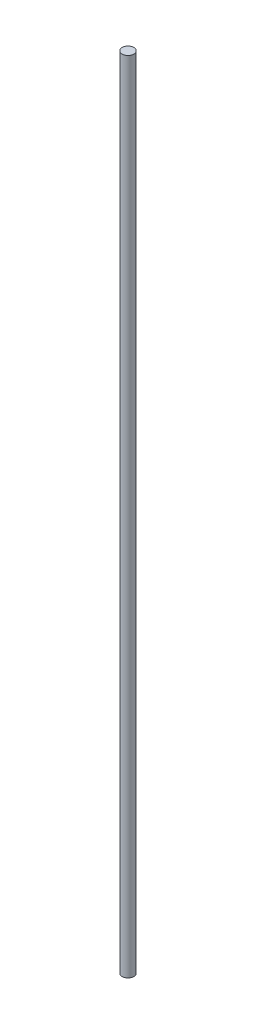
ISO-10303-21;
HEADER;
FILE_DESCRIPTION(('STEP AP214'),'2;1');
FILE_NAME('part.step','',(''),(''),'','','');
FILE_SCHEMA(('AUTOMOTIVE_DESIGN { 1 0 10303 214 1 1 1 1 }'));
ENDSEC;
DATA;
#1=APPLICATION_CONTEXT('core data for automotive mechanical design processes');
#2=APPLICATION_PROTOCOL_DEFINITION('international standard','automotive_design',2000,#1);
#3=PRODUCT_CONTEXT('',#1,'mechanical');
#4=PRODUCT('Part','Part','',(#3));
#5=PRODUCT_RELATED_PRODUCT_CATEGORY('part','',(#4));
#6=PRODUCT_DEFINITION_FORMATION('','',#4);
#7=PRODUCT_DEFINITION_CONTEXT('part definition',#1,'design');
#8=PRODUCT_DEFINITION('design','',#6,#7);
#9=PRODUCT_DEFINITION_SHAPE('','',#8);
#10=(LENGTH_UNIT() NAMED_UNIT(*) SI_UNIT(.MILLI.,.METRE.));
#11=(NAMED_UNIT(*) PLANE_ANGLE_UNIT() SI_UNIT($,.RADIAN.));
#12=(NAMED_UNIT(*) SI_UNIT($,.STERADIAN.) SOLID_ANGLE_UNIT());
#13=UNCERTAINTY_MEASURE_WITH_UNIT(LENGTH_MEASURE(1.E-05),#10,'distance_accuracy_value','');
#14=(GEOMETRIC_REPRESENTATION_CONTEXT(3) GLOBAL_UNCERTAINTY_ASSIGNED_CONTEXT((#13)) GLOBAL_UNIT_ASSIGNED_CONTEXT((#10,
#11,#12)) REPRESENTATION_CONTEXT('',''));
#15=CARTESIAN_POINT('',(0.,0.,0.));
#16=DIRECTION('',(0.,0.,1.));
#17=DIRECTION('',(1.,0.,0.));
#18=AXIS2_PLACEMENT_3D('',#15,#16,#17);
#19=CARTESIAN_POINT('',(0.,205.8,0.));
#20=DIRECTION('',(0.,-1.,0.));
#21=DIRECTION('',(0.,0.,-1.));
#22=AXIS2_PLACEMENT_3D('',#19,#20,#21);
#23=CYLINDRICAL_SURFACE('',#22,1.5);
#24=CARTESIAN_POINT('',(0.,205.8,0.));
#25=DIRECTION('',(0.,1.,0.));
#26=DIRECTION('',(0.,0.,1.));
#27=AXIS2_PLACEMENT_3D('',#24,#25,#26);
#28=CIRCLE('',#27,1.5);
#29=CARTESIAN_POINT('',(0.,205.8,1.5));
#30=VERTEX_POINT('',#29);
#31=EDGE_CURVE('E10',#30,#30,#28,.T.);
#32=ORIENTED_EDGE('',*,*,#31,.F.);
#33=EDGE_LOOP('',(#32));
#34=FACE_BOUND('',#33,.T.);
#35=CARTESIAN_POINT('',(0.,0.,0.));
#36=DIRECTION('',(0.,1.,0.));
#37=DIRECTION('',(0.,0.,1.));
#38=AXIS2_PLACEMENT_3D('',#35,#36,#37);
#39=CIRCLE('',#38,1.5);
#40=CARTESIAN_POINT('',(0.,0.,1.5));
#41=VERTEX_POINT('',#40);
#42=EDGE_CURVE('E34',#41,#41,#39,.T.);
#43=ORIENTED_EDGE('',*,*,#42,.T.);
#44=EDGE_LOOP('',(#43));
#45=FACE_BOUND('',#44,.T.);
#46=ADVANCED_FACE('F31',(#34,#45),#23,.T.);
#47=CARTESIAN_POINT('',(0.,205.8,0.));
#48=DIRECTION('',(0.,1.,0.));
#49=DIRECTION('',(0.,0.,1.));
#50=AXIS2_PLACEMENT_3D('',#47,#48,#49);
#51=PLANE('',#50);
#52=ORIENTED_EDGE('',*,*,#31,.T.);
#53=EDGE_LOOP('',(#52));
#54=FACE_BOUND('',#53,.T.);
#55=ADVANCED_FACE('F46',(#54),#51,.T.);
#56=CARTESIAN_POINT('',(0.,0.,0.));
#57=DIRECTION('',(0.,1.,0.));
#58=DIRECTION('',(0.,0.,1.));
#59=AXIS2_PLACEMENT_3D('',#56,#57,#58);
#60=PLANE('',#59);
#61=ORIENTED_EDGE('',*,*,#42,.F.);
#62=EDGE_LOOP('',(#61));
#63=FACE_BOUND('',#62,.T.);
#64=ADVANCED_FACE('F44',(#63),#60,.F.);
#65=CLOSED_SHELL('',(#46,#55,#64));
#66=MANIFOLD_SOLID_BREP('B2',#65);
#67=ADVANCED_BREP_SHAPE_REPRESENTATION('',(#18,#66),#14);
#68=SHAPE_DEFINITION_REPRESENTATION(#9,#67);
ENDSEC;
END-ISO-10303-21;
